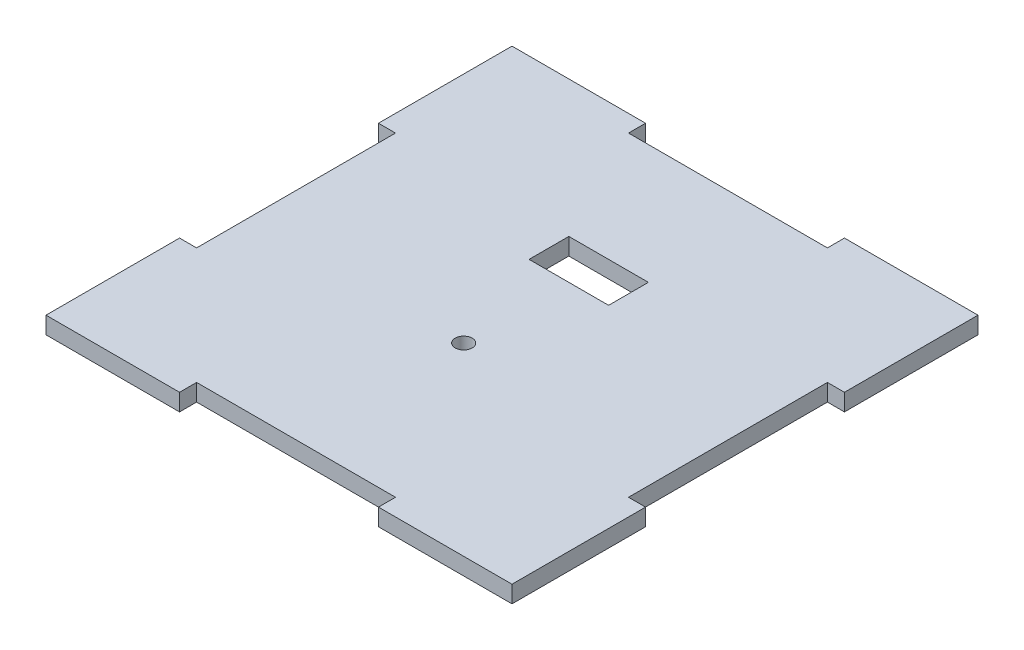
ISO-10303-21;
HEADER;
FILE_DESCRIPTION(('STEP AP214'),'2;1');
FILE_NAME('part.step','',(''),(''),'','','');
FILE_SCHEMA(('AUTOMOTIVE_DESIGN { 1 0 10303 214 1 1 1 1 }'));
ENDSEC;
DATA;
#1=APPLICATION_CONTEXT('core data for automotive mechanical design processes');
#2=APPLICATION_PROTOCOL_DEFINITION('international standard','automotive_design',2000,#1);
#3=PRODUCT_CONTEXT('',#1,'mechanical');
#4=PRODUCT('Part','Part','',(#3));
#5=PRODUCT_RELATED_PRODUCT_CATEGORY('part','',(#4));
#6=PRODUCT_DEFINITION_FORMATION('','',#4);
#7=PRODUCT_DEFINITION_CONTEXT('part definition',#1,'design');
#8=PRODUCT_DEFINITION('design','',#6,#7);
#9=PRODUCT_DEFINITION_SHAPE('','',#8);
#10=(LENGTH_UNIT() NAMED_UNIT(*) SI_UNIT(.MILLI.,.METRE.));
#11=(NAMED_UNIT(*) PLANE_ANGLE_UNIT() SI_UNIT($,.RADIAN.));
#12=(NAMED_UNIT(*) SI_UNIT($,.STERADIAN.) SOLID_ANGLE_UNIT());
#13=UNCERTAINTY_MEASURE_WITH_UNIT(LENGTH_MEASURE(1.E-05),#10,'distance_accuracy_value','');
#14=(GEOMETRIC_REPRESENTATION_CONTEXT(3) GLOBAL_UNCERTAINTY_ASSIGNED_CONTEXT((#13)) GLOBAL_UNIT_ASSIGNED_CONTEXT((#10,
#11,#12)) REPRESENTATION_CONTEXT('',''));
#15=CARTESIAN_POINT('',(0.,0.,0.));
#16=DIRECTION('',(0.,0.,1.));
#17=DIRECTION('',(1.,0.,0.));
#18=AXIS2_PLACEMENT_3D('',#15,#16,#17);
#19=CARTESIAN_POINT('',(41.,3.,-17.5));
#20=DIRECTION('',(-1.,0.,0.));
#21=DIRECTION('',(0.,0.,1.));
#22=AXIS2_PLACEMENT_3D('',#19,#20,#21);
#23=PLANE('',#22);
#24=DIRECTION('',(0.,0.,-1.));
#25=VECTOR('',#24,1.);
#26=CARTESIAN_POINT('',(41.,0.,-17.5));
#27=LINE('',#26,#25);
#28=CARTESIAN_POINT('',(41.,0.,-17.5));
#29=VERTEX_POINT('',#28);
#30=CARTESIAN_POINT('',(41.,0.,-41.));
#31=VERTEX_POINT('',#30);
#32=EDGE_CURVE('E243',#29,#31,#27,.T.);
#33=ORIENTED_EDGE('',*,*,#32,.T.);
#34=DIRECTION('',(0.,-1.,0.));
#35=VECTOR('',#34,1.);
#36=CARTESIAN_POINT('',(41.,3.,-41.));
#37=LINE('',#36,#35);
#38=CARTESIAN_POINT('',(41.,3.,-41.));
#39=VERTEX_POINT('',#38);
#40=EDGE_CURVE('E11',#39,#31,#37,.T.);
#41=ORIENTED_EDGE('',*,*,#40,.F.);
#42=DIRECTION('',(0.,0.,-1.));
#43=VECTOR('',#42,1.);
#44=CARTESIAN_POINT('',(41.,3.,-17.5));
#45=LINE('',#44,#43);
#46=CARTESIAN_POINT('',(41.,3.,-17.5));
#47=VERTEX_POINT('',#46);
#48=EDGE_CURVE('E256',#47,#39,#45,.T.);
#49=ORIENTED_EDGE('',*,*,#48,.F.);
#50=DIRECTION('',(0.,-1.,0.));
#51=VECTOR('',#50,1.);
#52=CARTESIAN_POINT('',(41.,3.,-17.5));
#53=LINE('',#52,#51);
#54=EDGE_CURVE('E318',#47,#29,#53,.T.);
#55=ORIENTED_EDGE('',*,*,#54,.T.);
#56=EDGE_LOOP('',(#33,#41,#49,#55));
#57=FACE_BOUND('',#56,.T.);
#58=ADVANCED_FACE('F38',(#57),#23,.F.);
#59=CARTESIAN_POINT('',(17.5,3.,-41.));
#60=DIRECTION('',(0.,0.,1.));
#61=DIRECTION('',(1.,0.,0.));
#62=AXIS2_PLACEMENT_3D('',#59,#60,#61);
#63=PLANE('',#62);
#64=DIRECTION('',(-1.,0.,0.));
#65=VECTOR('',#64,1.);
#66=CARTESIAN_POINT('',(17.5,0.,-41.));
#67=LINE('',#66,#65);
#68=CARTESIAN_POINT('',(17.5,0.,-41.));
#69=VERTEX_POINT('',#68);
#70=EDGE_CURVE('E322',#31,#69,#67,.T.);
#71=ORIENTED_EDGE('',*,*,#70,.T.);
#72=DIRECTION('',(0.,-1.,0.));
#73=VECTOR('',#72,1.);
#74=CARTESIAN_POINT('',(17.5,3.,-41.));
#75=LINE('',#74,#73);
#76=CARTESIAN_POINT('',(17.5,3.,-41.));
#77=VERTEX_POINT('',#76);
#78=EDGE_CURVE('E46',#77,#69,#75,.T.);
#79=ORIENTED_EDGE('',*,*,#78,.F.);
#80=DIRECTION('',(-1.,0.,0.));
#81=VECTOR('',#80,1.);
#82=CARTESIAN_POINT('',(17.5,3.,-41.));
#83=LINE('',#82,#81);
#84=EDGE_CURVE('E260',#39,#77,#83,.T.);
#85=ORIENTED_EDGE('',*,*,#84,.F.);
#86=ORIENTED_EDGE('',*,*,#40,.T.);
#87=EDGE_LOOP('',(#71,#79,#85,#86));
#88=FACE_BOUND('',#87,.T.);
#89=ADVANCED_FACE('F476',(#88),#63,.F.);
#90=CARTESIAN_POINT('',(17.5,3.,-38.));
#91=DIRECTION('',(1.,0.,0.));
#92=DIRECTION('',(0.,0.,-1.));
#93=AXIS2_PLACEMENT_3D('',#90,#91,#92);
#94=PLANE('',#93);
#95=DIRECTION('',(0.,0.,1.));
#96=VECTOR('',#95,1.);
#97=CARTESIAN_POINT('',(17.5,0.,-38.));
#98=LINE('',#97,#96);
#99=CARTESIAN_POINT('',(17.5,0.,-38.));
#100=VERTEX_POINT('',#99);
#101=EDGE_CURVE('E325',#69,#100,#98,.T.);
#102=ORIENTED_EDGE('',*,*,#101,.T.);
#103=DIRECTION('',(0.,-1.,0.));
#104=VECTOR('',#103,1.);
#105=CARTESIAN_POINT('',(17.5,3.,-38.));
#106=LINE('',#105,#104);
#107=CARTESIAN_POINT('',(17.5,3.,-38.));
#108=VERTEX_POINT('',#107);
#109=EDGE_CURVE('E445',#108,#100,#106,.T.);
#110=ORIENTED_EDGE('',*,*,#109,.F.);
#111=DIRECTION('',(0.,0.,1.));
#112=VECTOR('',#111,1.);
#113=CARTESIAN_POINT('',(17.5,3.,-38.));
#114=LINE('',#113,#112);
#115=EDGE_CURVE('E264',#77,#108,#114,.T.);
#116=ORIENTED_EDGE('',*,*,#115,.F.);
#117=ORIENTED_EDGE('',*,*,#78,.T.);
#118=EDGE_LOOP('',(#102,#110,#116,#117));
#119=FACE_BOUND('',#118,.T.);
#120=ADVANCED_FACE('F454',(#119),#94,.F.);
#121=CARTESIAN_POINT('',(-17.5,3.,-38.));
#122=DIRECTION('',(0.,0.,1.));
#123=DIRECTION('',(1.,0.,0.));
#124=AXIS2_PLACEMENT_3D('',#121,#122,#123);
#125=PLANE('',#124);
#126=DIRECTION('',(-1.,0.,0.));
#127=VECTOR('',#126,1.);
#128=CARTESIAN_POINT('',(-17.5,0.,-38.));
#129=LINE('',#128,#127);
#130=CARTESIAN_POINT('',(-17.5,0.,-38.));
#131=VERTEX_POINT('',#130);
#132=EDGE_CURVE('E328',#100,#131,#129,.T.);
#133=ORIENTED_EDGE('',*,*,#132,.T.);
#134=DIRECTION('',(0.,-1.,0.));
#135=VECTOR('',#134,1.);
#136=CARTESIAN_POINT('',(-17.5,3.,-38.));
#137=LINE('',#136,#135);
#138=CARTESIAN_POINT('',(-17.5,3.,-38.));
#139=VERTEX_POINT('',#138);
#140=EDGE_CURVE('E441',#139,#131,#137,.T.);
#141=ORIENTED_EDGE('',*,*,#140,.F.);
#142=DIRECTION('',(-1.,0.,0.));
#143=VECTOR('',#142,1.);
#144=CARTESIAN_POINT('',(-17.5,3.,-38.));
#145=LINE('',#144,#143);
#146=EDGE_CURVE('E267',#108,#139,#145,.T.);
#147=ORIENTED_EDGE('',*,*,#146,.F.);
#148=ORIENTED_EDGE('',*,*,#109,.T.);
#149=EDGE_LOOP('',(#133,#141,#147,#148));
#150=FACE_BOUND('',#149,.T.);
#151=ADVANCED_FACE('F464',(#150),#125,.F.);
#152=CARTESIAN_POINT('',(-17.5,3.,-41.));
#153=DIRECTION('',(-1.,0.,0.));
#154=DIRECTION('',(0.,0.,1.));
#155=AXIS2_PLACEMENT_3D('',#152,#153,#154);
#156=PLANE('',#155);
#157=DIRECTION('',(0.,0.,-1.));
#158=VECTOR('',#157,1.);
#159=CARTESIAN_POINT('',(-17.5,0.,-41.));
#160=LINE('',#159,#158);
#161=CARTESIAN_POINT('',(-17.5,0.,-41.));
#162=VERTEX_POINT('',#161);
#163=EDGE_CURVE('E331',#131,#162,#160,.T.);
#164=ORIENTED_EDGE('',*,*,#163,.T.);
#165=DIRECTION('',(0.,-1.,0.));
#166=VECTOR('',#165,1.);
#167=CARTESIAN_POINT('',(-17.5,3.,-41.));
#168=LINE('',#167,#166);
#169=CARTESIAN_POINT('',(-17.5,3.,-41.));
#170=VERTEX_POINT('',#169);
#171=EDGE_CURVE('E437',#170,#162,#168,.T.);
#172=ORIENTED_EDGE('',*,*,#171,.F.);
#173=DIRECTION('',(0.,0.,-1.));
#174=VECTOR('',#173,1.);
#175=CARTESIAN_POINT('',(-17.5,3.,-41.));
#176=LINE('',#175,#174);
#177=EDGE_CURVE('E270',#139,#170,#176,.T.);
#178=ORIENTED_EDGE('',*,*,#177,.F.);
#179=ORIENTED_EDGE('',*,*,#140,.T.);
#180=EDGE_LOOP('',(#164,#172,#178,#179));
#181=FACE_BOUND('',#180,.T.);
#182=ADVANCED_FACE('F468',(#181),#156,.F.);
#183=CARTESIAN_POINT('',(-41.,3.,-41.));
#184=DIRECTION('',(0.,0.,1.));
#185=DIRECTION('',(1.,0.,0.));
#186=AXIS2_PLACEMENT_3D('',#183,#184,#185);
#187=PLANE('',#186);
#188=DIRECTION('',(-1.,0.,0.));
#189=VECTOR('',#188,1.);
#190=CARTESIAN_POINT('',(-41.,0.,-41.));
#191=LINE('',#190,#189);
#192=CARTESIAN_POINT('',(-41.,0.,-41.));
#193=VERTEX_POINT('',#192);
#194=EDGE_CURVE('E334',#162,#193,#191,.T.);
#195=ORIENTED_EDGE('',*,*,#194,.T.);
#196=DIRECTION('',(0.,-1.,0.));
#197=VECTOR('',#196,1.);
#198=CARTESIAN_POINT('',(-41.,3.,-41.));
#199=LINE('',#198,#197);
#200=CARTESIAN_POINT('',(-41.,3.,-41.));
#201=VERTEX_POINT('',#200);
#202=EDGE_CURVE('E433',#201,#193,#199,.T.);
#203=ORIENTED_EDGE('',*,*,#202,.F.);
#204=DIRECTION('',(-1.,0.,0.));
#205=VECTOR('',#204,1.);
#206=CARTESIAN_POINT('',(-41.,3.,-41.));
#207=LINE('',#206,#205);
#208=EDGE_CURVE('E273',#170,#201,#207,.T.);
#209=ORIENTED_EDGE('',*,*,#208,.F.);
#210=ORIENTED_EDGE('',*,*,#171,.T.);
#211=EDGE_LOOP('',(#195,#203,#209,#210));
#212=FACE_BOUND('',#211,.T.);
#213=ADVANCED_FACE('F549',(#212),#187,.F.);
#214=CARTESIAN_POINT('',(-41.,3.,-17.5));
#215=DIRECTION('',(1.,0.,0.));
#216=DIRECTION('',(0.,0.,-1.));
#217=AXIS2_PLACEMENT_3D('',#214,#215,#216);
#218=PLANE('',#217);
#219=DIRECTION('',(0.,0.,1.));
#220=VECTOR('',#219,1.);
#221=CARTESIAN_POINT('',(-41.,0.,-17.5));
#222=LINE('',#221,#220);
#223=CARTESIAN_POINT('',(-41.,0.,-17.5));
#224=VERTEX_POINT('',#223);
#225=EDGE_CURVE('E337',#193,#224,#222,.T.);
#226=ORIENTED_EDGE('',*,*,#225,.T.);
#227=DIRECTION('',(0.,-1.,0.));
#228=VECTOR('',#227,1.);
#229=CARTESIAN_POINT('',(-41.,3.,-17.5));
#230=LINE('',#229,#228);
#231=CARTESIAN_POINT('',(-41.,3.,-17.5));
#232=VERTEX_POINT('',#231);
#233=EDGE_CURVE('E429',#232,#224,#230,.T.);
#234=ORIENTED_EDGE('',*,*,#233,.F.);
#235=DIRECTION('',(0.,0.,1.));
#236=VECTOR('',#235,1.);
#237=CARTESIAN_POINT('',(-41.,3.,-17.5));
#238=LINE('',#237,#236);
#239=EDGE_CURVE('E276',#201,#232,#238,.T.);
#240=ORIENTED_EDGE('',*,*,#239,.F.);
#241=ORIENTED_EDGE('',*,*,#202,.T.);
#242=EDGE_LOOP('',(#226,#234,#240,#241));
#243=FACE_BOUND('',#242,.T.);
#244=ADVANCED_FACE('F547',(#243),#218,.F.);
#245=CARTESIAN_POINT('',(-41.,3.,-17.5));
#246=DIRECTION('',(0.,0.,-1.));
#247=DIRECTION('',(-1.,0.,0.));
#248=AXIS2_PLACEMENT_3D('',#245,#246,#247);
#249=PLANE('',#248);
#250=DIRECTION('',(1.,0.,0.));
#251=VECTOR('',#250,1.);
#252=CARTESIAN_POINT('',(-41.,0.,-17.5));
#253=LINE('',#252,#251);
#254=CARTESIAN_POINT('',(-38.,0.,-17.5));
#255=VERTEX_POINT('',#254);
#256=EDGE_CURVE('E340',#224,#255,#253,.T.);
#257=ORIENTED_EDGE('',*,*,#256,.T.);
#258=DIRECTION('',(0.,-1.,0.));
#259=VECTOR('',#258,1.);
#260=CARTESIAN_POINT('',(-38.,3.,-17.5));
#261=LINE('',#260,#259);
#262=CARTESIAN_POINT('',(-38.,3.,-17.5));
#263=VERTEX_POINT('',#262);
#264=EDGE_CURVE('E425',#263,#255,#261,.T.);
#265=ORIENTED_EDGE('',*,*,#264,.F.);
#266=DIRECTION('',(1.,0.,0.));
#267=VECTOR('',#266,1.);
#268=CARTESIAN_POINT('',(-41.,3.,-17.5));
#269=LINE('',#268,#267);
#270=EDGE_CURVE('E279',#232,#263,#269,.T.);
#271=ORIENTED_EDGE('',*,*,#270,.F.);
#272=ORIENTED_EDGE('',*,*,#233,.T.);
#273=EDGE_LOOP('',(#257,#265,#271,#272));
#274=FACE_BOUND('',#273,.T.);
#275=ADVANCED_FACE('F542',(#274),#249,.F.);
#276=CARTESIAN_POINT('',(-38.,3.,-17.5));
#277=DIRECTION('',(1.,0.,0.));
#278=DIRECTION('',(0.,0.,-1.));
#279=AXIS2_PLACEMENT_3D('',#276,#277,#278);
#280=PLANE('',#279);
#281=DIRECTION('',(0.,0.,1.));
#282=VECTOR('',#281,1.);
#283=CARTESIAN_POINT('',(-38.,0.,-17.5));
#284=LINE('',#283,#282);
#285=CARTESIAN_POINT('',(-38.,0.,17.5));
#286=VERTEX_POINT('',#285);
#287=EDGE_CURVE('E343',#255,#286,#284,.T.);
#288=ORIENTED_EDGE('',*,*,#287,.T.);
#289=DIRECTION('',(0.,-1.,0.));
#290=VECTOR('',#289,1.);
#291=CARTESIAN_POINT('',(-38.,3.,17.5));
#292=LINE('',#291,#290);
#293=CARTESIAN_POINT('',(-38.,3.,17.5));
#294=VERTEX_POINT('',#293);
#295=EDGE_CURVE('E421',#294,#286,#292,.T.);
#296=ORIENTED_EDGE('',*,*,#295,.F.);
#297=DIRECTION('',(0.,0.,1.));
#298=VECTOR('',#297,1.);
#299=CARTESIAN_POINT('',(-38.,3.,-17.5));
#300=LINE('',#299,#298);
#301=EDGE_CURVE('E282',#263,#294,#300,.T.);
#302=ORIENTED_EDGE('',*,*,#301,.F.);
#303=ORIENTED_EDGE('',*,*,#264,.T.);
#304=EDGE_LOOP('',(#288,#296,#302,#303));
#305=FACE_BOUND('',#304,.T.);
#306=ADVANCED_FACE('F537',(#305),#280,.F.);
#307=CARTESIAN_POINT('',(-38.,3.,17.5));
#308=DIRECTION('',(0.,0.,1.));
#309=DIRECTION('',(1.,0.,0.));
#310=AXIS2_PLACEMENT_3D('',#307,#308,#309);
#311=PLANE('',#310);
#312=DIRECTION('',(-1.,0.,0.));
#313=VECTOR('',#312,1.);
#314=CARTESIAN_POINT('',(-38.,0.,17.5));
#315=LINE('',#314,#313);
#316=CARTESIAN_POINT('',(-41.,0.,17.5));
#317=VERTEX_POINT('',#316);
#318=EDGE_CURVE('E346',#286,#317,#315,.T.);
#319=ORIENTED_EDGE('',*,*,#318,.T.);
#320=DIRECTION('',(0.,-1.,0.));
#321=VECTOR('',#320,1.);
#322=CARTESIAN_POINT('',(-41.,3.,17.5));
#323=LINE('',#322,#321);
#324=CARTESIAN_POINT('',(-41.,3.,17.5));
#325=VERTEX_POINT('',#324);
#326=EDGE_CURVE('E417',#325,#317,#323,.T.);
#327=ORIENTED_EDGE('',*,*,#326,.F.);
#328=DIRECTION('',(-1.,0.,0.));
#329=VECTOR('',#328,1.);
#330=CARTESIAN_POINT('',(-38.,3.,17.5));
#331=LINE('',#330,#329);
#332=EDGE_CURVE('E285',#294,#325,#331,.T.);
#333=ORIENTED_EDGE('',*,*,#332,.F.);
#334=ORIENTED_EDGE('',*,*,#295,.T.);
#335=EDGE_LOOP('',(#319,#327,#333,#334));
#336=FACE_BOUND('',#335,.T.);
#337=ADVANCED_FACE('F533',(#336),#311,.F.);
#338=CARTESIAN_POINT('',(-41.,3.,41.));
#339=DIRECTION('',(1.,0.,0.));
#340=DIRECTION('',(0.,0.,-1.));
#341=AXIS2_PLACEMENT_3D('',#338,#339,#340);
#342=PLANE('',#341);
#343=DIRECTION('',(0.,0.,1.));
#344=VECTOR('',#343,1.);
#345=CARTESIAN_POINT('',(-41.,0.,41.));
#346=LINE('',#345,#344);
#347=CARTESIAN_POINT('',(-41.,0.,41.));
#348=VERTEX_POINT('',#347);
#349=EDGE_CURVE('E349',#317,#348,#346,.T.);
#350=ORIENTED_EDGE('',*,*,#349,.T.);
#351=DIRECTION('',(0.,-1.,0.));
#352=VECTOR('',#351,1.);
#353=CARTESIAN_POINT('',(-41.,3.,41.));
#354=LINE('',#353,#352);
#355=CARTESIAN_POINT('',(-41.,3.,41.));
#356=VERTEX_POINT('',#355);
#357=EDGE_CURVE('E413',#356,#348,#354,.T.);
#358=ORIENTED_EDGE('',*,*,#357,.F.);
#359=DIRECTION('',(0.,0.,1.));
#360=VECTOR('',#359,1.);
#361=CARTESIAN_POINT('',(-41.,3.,41.));
#362=LINE('',#361,#360);
#363=EDGE_CURVE('E288',#325,#356,#362,.T.);
#364=ORIENTED_EDGE('',*,*,#363,.F.);
#365=ORIENTED_EDGE('',*,*,#326,.T.);
#366=EDGE_LOOP('',(#350,#358,#364,#365));
#367=FACE_BOUND('',#366,.T.);
#368=ADVANCED_FACE('F528',(#367),#342,.F.);
#369=CARTESIAN_POINT('',(-41.,3.,41.));
#370=DIRECTION('',(0.,0.,-1.));
#371=DIRECTION('',(-1.,0.,0.));
#372=AXIS2_PLACEMENT_3D('',#369,#370,#371);
#373=PLANE('',#372);
#374=DIRECTION('',(1.,0.,0.));
#375=VECTOR('',#374,1.);
#376=CARTESIAN_POINT('',(-41.,0.,41.));
#377=LINE('',#376,#375);
#378=CARTESIAN_POINT('',(-17.5,0.,41.));
#379=VERTEX_POINT('',#378);
#380=EDGE_CURVE('E352',#348,#379,#377,.T.);
#381=ORIENTED_EDGE('',*,*,#380,.T.);
#382=DIRECTION('',(0.,-1.,0.));
#383=VECTOR('',#382,1.);
#384=CARTESIAN_POINT('',(-17.5,3.,41.));
#385=LINE('',#384,#383);
#386=CARTESIAN_POINT('',(-17.5,3.,41.));
#387=VERTEX_POINT('',#386);
#388=EDGE_CURVE('E409',#387,#379,#385,.T.);
#389=ORIENTED_EDGE('',*,*,#388,.F.);
#390=DIRECTION('',(1.,0.,0.));
#391=VECTOR('',#390,1.);
#392=CARTESIAN_POINT('',(-41.,3.,41.));
#393=LINE('',#392,#391);
#394=EDGE_CURVE('E291',#356,#387,#393,.T.);
#395=ORIENTED_EDGE('',*,*,#394,.F.);
#396=ORIENTED_EDGE('',*,*,#357,.T.);
#397=EDGE_LOOP('',(#381,#389,#395,#396));
#398=FACE_BOUND('',#397,.T.);
#399=ADVANCED_FACE('F522',(#398),#373,.F.);
#400=CARTESIAN_POINT('',(-17.5,3.,38.));
#401=DIRECTION('',(-1.,0.,0.));
#402=DIRECTION('',(0.,0.,1.));
#403=AXIS2_PLACEMENT_3D('',#400,#401,#402);
#404=PLANE('',#403);
#405=DIRECTION('',(0.,0.,-1.));
#406=VECTOR('',#405,1.);
#407=CARTESIAN_POINT('',(-17.5,0.,38.));
#408=LINE('',#407,#406);
#409=CARTESIAN_POINT('',(-17.5,0.,38.));
#410=VERTEX_POINT('',#409);
#411=EDGE_CURVE('E355',#379,#410,#408,.T.);
#412=ORIENTED_EDGE('',*,*,#411,.T.);
#413=DIRECTION('',(0.,-1.,0.));
#414=VECTOR('',#413,1.);
#415=CARTESIAN_POINT('',(-17.5,3.,38.));
#416=LINE('',#415,#414);
#417=CARTESIAN_POINT('',(-17.5,3.,38.));
#418=VERTEX_POINT('',#417);
#419=EDGE_CURVE('E405',#418,#410,#416,.T.);
#420=ORIENTED_EDGE('',*,*,#419,.F.);
#421=DIRECTION('',(0.,0.,-1.));
#422=VECTOR('',#421,1.);
#423=CARTESIAN_POINT('',(-17.5,3.,38.));
#424=LINE('',#423,#422);
#425=EDGE_CURVE('E294',#387,#418,#424,.T.);
#426=ORIENTED_EDGE('',*,*,#425,.F.);
#427=ORIENTED_EDGE('',*,*,#388,.T.);
#428=EDGE_LOOP('',(#412,#420,#426,#427));
#429=FACE_BOUND('',#428,.T.);
#430=ADVANCED_FACE('F518',(#429),#404,.F.);
#431=CARTESIAN_POINT('',(17.5,3.,38.));
#432=DIRECTION('',(0.,0.,-1.));
#433=DIRECTION('',(-1.,0.,0.));
#434=AXIS2_PLACEMENT_3D('',#431,#432,#433);
#435=PLANE('',#434);
#436=DIRECTION('',(1.,0.,0.));
#437=VECTOR('',#436,1.);
#438=CARTESIAN_POINT('',(17.5,0.,38.));
#439=LINE('',#438,#437);
#440=CARTESIAN_POINT('',(17.5,0.,38.));
#441=VERTEX_POINT('',#440);
#442=EDGE_CURVE('E358',#410,#441,#439,.T.);
#443=ORIENTED_EDGE('',*,*,#442,.T.);
#444=DIRECTION('',(0.,-1.,0.));
#445=VECTOR('',#444,1.);
#446=CARTESIAN_POINT('',(17.5,3.,38.));
#447=LINE('',#446,#445);
#448=CARTESIAN_POINT('',(17.5,3.,38.));
#449=VERTEX_POINT('',#448);
#450=EDGE_CURVE('E401',#449,#441,#447,.T.);
#451=ORIENTED_EDGE('',*,*,#450,.F.);
#452=DIRECTION('',(1.,0.,0.));
#453=VECTOR('',#452,1.);
#454=CARTESIAN_POINT('',(17.5,3.,38.));
#455=LINE('',#454,#453);
#456=EDGE_CURVE('E297',#418,#449,#455,.T.);
#457=ORIENTED_EDGE('',*,*,#456,.F.);
#458=ORIENTED_EDGE('',*,*,#419,.T.);
#459=EDGE_LOOP('',(#443,#451,#457,#458));
#460=FACE_BOUND('',#459,.T.);
#461=ADVANCED_FACE('F513',(#460),#435,.F.);
#462=CARTESIAN_POINT('',(17.5,3.,41.));
#463=DIRECTION('',(1.,0.,0.));
#464=DIRECTION('',(0.,0.,-1.));
#465=AXIS2_PLACEMENT_3D('',#462,#463,#464);
#466=PLANE('',#465);
#467=DIRECTION('',(0.,0.,1.));
#468=VECTOR('',#467,1.);
#469=CARTESIAN_POINT('',(17.5,0.,41.));
#470=LINE('',#469,#468);
#471=CARTESIAN_POINT('',(17.5,0.,41.));
#472=VERTEX_POINT('',#471);
#473=EDGE_CURVE('E361',#441,#472,#470,.T.);
#474=ORIENTED_EDGE('',*,*,#473,.T.);
#475=DIRECTION('',(0.,-1.,0.));
#476=VECTOR('',#475,1.);
#477=CARTESIAN_POINT('',(17.5,3.,41.));
#478=LINE('',#477,#476);
#479=CARTESIAN_POINT('',(17.5,3.,41.));
#480=VERTEX_POINT('',#479);
#481=EDGE_CURVE('E397',#480,#472,#478,.T.);
#482=ORIENTED_EDGE('',*,*,#481,.F.);
#483=DIRECTION('',(0.,0.,1.));
#484=VECTOR('',#483,1.);
#485=CARTESIAN_POINT('',(17.5,3.,41.));
#486=LINE('',#485,#484);
#487=EDGE_CURVE('E300',#449,#480,#486,.T.);
#488=ORIENTED_EDGE('',*,*,#487,.F.);
#489=ORIENTED_EDGE('',*,*,#450,.T.);
#490=EDGE_LOOP('',(#474,#482,#488,#489));
#491=FACE_BOUND('',#490,.T.);
#492=ADVANCED_FACE('F507',(#491),#466,.F.);
#493=CARTESIAN_POINT('',(17.5,3.,41.));
#494=DIRECTION('',(0.,0.,-1.));
#495=DIRECTION('',(-1.,0.,0.));
#496=AXIS2_PLACEMENT_3D('',#493,#494,#495);
#497=PLANE('',#496);
#498=DIRECTION('',(1.,0.,0.));
#499=VECTOR('',#498,1.);
#500=CARTESIAN_POINT('',(17.5,0.,41.));
#501=LINE('',#500,#499);
#502=CARTESIAN_POINT('',(41.,0.,41.));
#503=VERTEX_POINT('',#502);
#504=EDGE_CURVE('E364',#472,#503,#501,.T.);
#505=ORIENTED_EDGE('',*,*,#504,.T.);
#506=DIRECTION('',(0.,-1.,0.));
#507=VECTOR('',#506,1.);
#508=CARTESIAN_POINT('',(41.,3.,41.));
#509=LINE('',#508,#507);
#510=CARTESIAN_POINT('',(41.,3.,41.));
#511=VERTEX_POINT('',#510);
#512=EDGE_CURVE('E393',#511,#503,#509,.T.);
#513=ORIENTED_EDGE('',*,*,#512,.F.);
#514=DIRECTION('',(1.,0.,0.));
#515=VECTOR('',#514,1.);
#516=CARTESIAN_POINT('',(17.5,3.,41.));
#517=LINE('',#516,#515);
#518=EDGE_CURVE('E303',#480,#511,#517,.T.);
#519=ORIENTED_EDGE('',*,*,#518,.F.);
#520=ORIENTED_EDGE('',*,*,#481,.T.);
#521=EDGE_LOOP('',(#505,#513,#519,#520));
#522=FACE_BOUND('',#521,.T.);
#523=ADVANCED_FACE('F503',(#522),#497,.F.);
#524=CARTESIAN_POINT('',(41.,3.,41.));
#525=DIRECTION('',(-1.,0.,0.));
#526=DIRECTION('',(0.,0.,1.));
#527=AXIS2_PLACEMENT_3D('',#524,#525,#526);
#528=PLANE('',#527);
#529=DIRECTION('',(0.,0.,-1.));
#530=VECTOR('',#529,1.);
#531=CARTESIAN_POINT('',(41.,0.,41.));
#532=LINE('',#531,#530);
#533=CARTESIAN_POINT('',(41.,0.,17.5));
#534=VERTEX_POINT('',#533);
#535=EDGE_CURVE('E367',#503,#534,#532,.T.);
#536=ORIENTED_EDGE('',*,*,#535,.T.);
#537=DIRECTION('',(0.,-1.,0.));
#538=VECTOR('',#537,1.);
#539=CARTESIAN_POINT('',(41.,3.,17.5));
#540=LINE('',#539,#538);
#541=CARTESIAN_POINT('',(41.,3.,17.5));
#542=VERTEX_POINT('',#541);
#543=EDGE_CURVE('E389',#542,#534,#540,.T.);
#544=ORIENTED_EDGE('',*,*,#543,.F.);
#545=DIRECTION('',(0.,0.,-1.));
#546=VECTOR('',#545,1.);
#547=CARTESIAN_POINT('',(41.,3.,41.));
#548=LINE('',#547,#546);
#549=EDGE_CURVE('E306',#511,#542,#548,.T.);
#550=ORIENTED_EDGE('',*,*,#549,.F.);
#551=ORIENTED_EDGE('',*,*,#512,.T.);
#552=EDGE_LOOP('',(#536,#544,#550,#551));
#553=FACE_BOUND('',#552,.T.);
#554=ADVANCED_FACE('F498',(#553),#528,.F.);
#555=CARTESIAN_POINT('',(38.,3.,17.5));
#556=DIRECTION('',(0.,0.,1.));
#557=DIRECTION('',(1.,0.,0.));
#558=AXIS2_PLACEMENT_3D('',#555,#556,#557);
#559=PLANE('',#558);
#560=DIRECTION('',(-1.,0.,0.));
#561=VECTOR('',#560,1.);
#562=CARTESIAN_POINT('',(38.,0.,17.5));
#563=LINE('',#562,#561);
#564=CARTESIAN_POINT('',(38.,0.,17.5));
#565=VERTEX_POINT('',#564);
#566=EDGE_CURVE('E370',#534,#565,#563,.T.);
#567=ORIENTED_EDGE('',*,*,#566,.T.);
#568=DIRECTION('',(0.,-1.,0.));
#569=VECTOR('',#568,1.);
#570=CARTESIAN_POINT('',(38.,3.,17.5));
#571=LINE('',#570,#569);
#572=CARTESIAN_POINT('',(38.,3.,17.5));
#573=VERTEX_POINT('',#572);
#574=EDGE_CURVE('E385',#573,#565,#571,.T.);
#575=ORIENTED_EDGE('',*,*,#574,.F.);
#576=DIRECTION('',(-1.,0.,0.));
#577=VECTOR('',#576,1.);
#578=CARTESIAN_POINT('',(38.,3.,17.5));
#579=LINE('',#578,#577);
#580=EDGE_CURVE('E309',#542,#573,#579,.T.);
#581=ORIENTED_EDGE('',*,*,#580,.F.);
#582=ORIENTED_EDGE('',*,*,#543,.T.);
#583=EDGE_LOOP('',(#567,#575,#581,#582));
#584=FACE_BOUND('',#583,.T.);
#585=ADVANCED_FACE('F492',(#584),#559,.F.);
#586=CARTESIAN_POINT('',(38.,3.,-17.5));
#587=DIRECTION('',(-1.,0.,0.));
#588=DIRECTION('',(0.,0.,1.));
#589=AXIS2_PLACEMENT_3D('',#586,#587,#588);
#590=PLANE('',#589);
#591=DIRECTION('',(0.,0.,-1.));
#592=VECTOR('',#591,1.);
#593=CARTESIAN_POINT('',(38.,0.,-17.5));
#594=LINE('',#593,#592);
#595=CARTESIAN_POINT('',(38.,0.,-17.5));
#596=VERTEX_POINT('',#595);
#597=EDGE_CURVE('E373',#565,#596,#594,.T.);
#598=ORIENTED_EDGE('',*,*,#597,.T.);
#599=DIRECTION('',(0.,-1.,0.));
#600=VECTOR('',#599,1.);
#601=CARTESIAN_POINT('',(38.,3.,-17.5));
#602=LINE('',#601,#600);
#603=CARTESIAN_POINT('',(38.,3.,-17.5));
#604=VERTEX_POINT('',#603);
#605=EDGE_CURVE('E381',#604,#596,#602,.T.);
#606=ORIENTED_EDGE('',*,*,#605,.F.);
#607=DIRECTION('',(0.,0.,-1.));
#608=VECTOR('',#607,1.);
#609=CARTESIAN_POINT('',(38.,3.,-17.5));
#610=LINE('',#609,#608);
#611=EDGE_CURVE('E312',#573,#604,#610,.T.);
#612=ORIENTED_EDGE('',*,*,#611,.F.);
#613=ORIENTED_EDGE('',*,*,#574,.T.);
#614=EDGE_LOOP('',(#598,#606,#612,#613));
#615=FACE_BOUND('',#614,.T.);
#616=ADVANCED_FACE('F488',(#615),#590,.F.);
#617=CARTESIAN_POINT('',(41.,3.,-17.5));
#618=DIRECTION('',(0.,0.,-1.));
#619=DIRECTION('',(-1.,0.,0.));
#620=AXIS2_PLACEMENT_3D('',#617,#618,#619);
#621=PLANE('',#620);
#622=DIRECTION('',(1.,0.,0.));
#623=VECTOR('',#622,1.);
#624=CARTESIAN_POINT('',(41.,0.,-17.5));
#625=LINE('',#624,#623);
#626=EDGE_CURVE('E261',#596,#29,#625,.T.);
#627=ORIENTED_EDGE('',*,*,#626,.T.);
#628=ORIENTED_EDGE('',*,*,#54,.F.);
#629=DIRECTION('',(1.,0.,0.));
#630=VECTOR('',#629,1.);
#631=CARTESIAN_POINT('',(41.,3.,-17.5));
#632=LINE('',#631,#630);
#633=EDGE_CURVE('E315',#604,#47,#632,.T.);
#634=ORIENTED_EDGE('',*,*,#633,.F.);
#635=ORIENTED_EDGE('',*,*,#605,.T.);
#636=EDGE_LOOP('',(#627,#628,#634,#635));
#637=FACE_BOUND('',#636,.T.);
#638=ADVANCED_FACE('F483',(#637),#621,.F.);
#639=CARTESIAN_POINT('',(0.,3.,0.));
#640=DIRECTION('',(0.,-1.,0.));
#641=DIRECTION('',(0.,0.,-1.));
#642=AXIS2_PLACEMENT_3D('',#639,#640,#641);
#643=PLANE('',#642);
#644=DIRECTION('',(-1.,0.,0.));
#645=VECTOR('',#644,1.);
#646=CARTESIAN_POINT('',(-7.,3.,-17.));
#647=LINE('',#646,#645);
#648=CARTESIAN_POINT('',(7.,3.,-17.));
#649=VERTEX_POINT('',#648);
#650=CARTESIAN_POINT('',(-7.,3.,-17.));
#651=VERTEX_POINT('',#650);
#652=EDGE_CURVE('E233',#649,#651,#647,.T.);
#653=ORIENTED_EDGE('',*,*,#652,.F.);
#654=DIRECTION('',(0.,0.,-1.));
#655=VECTOR('',#654,1.);
#656=CARTESIAN_POINT('',(7.,3.,-17.));
#657=LINE('',#656,#655);
#658=CARTESIAN_POINT('',(7.00000000000001,3.,-10.));
#659=VERTEX_POINT('',#658);
#660=EDGE_CURVE('E53',#659,#649,#657,.T.);
#661=ORIENTED_EDGE('',*,*,#660,.F.);
#662=DIRECTION('',(1.,0.,0.));
#663=VECTOR('',#662,1.);
#664=CARTESIAN_POINT('',(-7.,3.,-10.));
#665=LINE('',#664,#663);
#666=CARTESIAN_POINT('',(-7.,3.,-10.));
#667=VERTEX_POINT('',#666);
#668=EDGE_CURVE('E220',#667,#659,#665,.T.);
#669=ORIENTED_EDGE('',*,*,#668,.F.);
#670=DIRECTION('',(0.,0.,1.));
#671=VECTOR('',#670,1.);
#672=CARTESIAN_POINT('',(-7.,3.,-17.));
#673=LINE('',#672,#671);
#674=EDGE_CURVE('E224',#651,#667,#673,.T.);
#675=ORIENTED_EDGE('',*,*,#674,.F.);
#676=EDGE_LOOP('',(#653,#661,#669,#675));
#677=FACE_BOUND('',#676,.T.);
#678=CARTESIAN_POINT('',(0.,3.,8.5));
#679=DIRECTION('',(0.,1.,0.));
#680=DIRECTION('',(0.,0.,1.));
#681=AXIS2_PLACEMENT_3D('',#678,#679,#680);
#682=CIRCLE('',#681,1.5);
#683=CARTESIAN_POINT('',(0.,3.,10.));
#684=VERTEX_POINT('',#683);
#685=EDGE_CURVE('E252',#684,#684,#682,.T.);
#686=ORIENTED_EDGE('',*,*,#685,.F.);
#687=EDGE_LOOP('',(#686));
#688=FACE_BOUND('',#687,.T.);
#689=ORIENTED_EDGE('',*,*,#48,.T.);
#690=ORIENTED_EDGE('',*,*,#84,.T.);
#691=ORIENTED_EDGE('',*,*,#115,.T.);
#692=ORIENTED_EDGE('',*,*,#146,.T.);
#693=ORIENTED_EDGE('',*,*,#177,.T.);
#694=ORIENTED_EDGE('',*,*,#208,.T.);
#695=ORIENTED_EDGE('',*,*,#239,.T.);
#696=ORIENTED_EDGE('',*,*,#270,.T.);
#697=ORIENTED_EDGE('',*,*,#301,.T.);
#698=ORIENTED_EDGE('',*,*,#332,.T.);
#699=ORIENTED_EDGE('',*,*,#363,.T.);
#700=ORIENTED_EDGE('',*,*,#394,.T.);
#701=ORIENTED_EDGE('',*,*,#425,.T.);
#702=ORIENTED_EDGE('',*,*,#456,.T.);
#703=ORIENTED_EDGE('',*,*,#487,.T.);
#704=ORIENTED_EDGE('',*,*,#518,.T.);
#705=ORIENTED_EDGE('',*,*,#549,.T.);
#706=ORIENTED_EDGE('',*,*,#580,.T.);
#707=ORIENTED_EDGE('',*,*,#611,.T.);
#708=ORIENTED_EDGE('',*,*,#633,.T.);
#709=EDGE_LOOP('',(#689,#690,#691,#692,#693,#694,#695,#696,#697,#698,#699,#700,#701,#702,#703,
#704,#705,#706,#707,#708));
#710=FACE_BOUND('',#709,.T.);
#711=ADVANCED_FACE('F472',(#677,#688,#710),#643,.F.);
#712=CARTESIAN_POINT('',(0.,0.,0.));
#713=DIRECTION('',(0.,-1.,0.));
#714=DIRECTION('',(0.,0.,-1.));
#715=AXIS2_PLACEMENT_3D('',#712,#713,#714);
#716=PLANE('',#715);
#717=DIRECTION('',(0.,0.,-1.));
#718=VECTOR('',#717,1.);
#719=CARTESIAN_POINT('',(7.,0.,-17.));
#720=LINE('',#719,#718);
#721=CARTESIAN_POINT('',(7.00000000000001,0.,-10.));
#722=VERTEX_POINT('',#721);
#723=CARTESIAN_POINT('',(7.,0.,-17.));
#724=VERTEX_POINT('',#723);
#725=EDGE_CURVE('E201',#722,#724,#720,.T.);
#726=ORIENTED_EDGE('',*,*,#725,.T.);
#727=DIRECTION('',(-1.,0.,0.));
#728=VECTOR('',#727,1.);
#729=CARTESIAN_POINT('',(-7.,0.,-17.));
#730=LINE('',#729,#728);
#731=CARTESIAN_POINT('',(-7.,0.,-17.));
#732=VERTEX_POINT('',#731);
#733=EDGE_CURVE('E211',#724,#732,#730,.T.);
#734=ORIENTED_EDGE('',*,*,#733,.T.);
#735=DIRECTION('',(0.,0.,1.));
#736=VECTOR('',#735,1.);
#737=CARTESIAN_POINT('',(-7.,0.,-17.));
#738=LINE('',#737,#736);
#739=CARTESIAN_POINT('',(-7.,0.,-10.));
#740=VERTEX_POINT('',#739);
#741=EDGE_CURVE('E61',#732,#740,#738,.T.);
#742=ORIENTED_EDGE('',*,*,#741,.T.);
#743=DIRECTION('',(1.,0.,0.));
#744=VECTOR('',#743,1.);
#745=CARTESIAN_POINT('',(-7.,0.,-10.));
#746=LINE('',#745,#744);
#747=EDGE_CURVE('E208',#740,#722,#746,.T.);
#748=ORIENTED_EDGE('',*,*,#747,.T.);
#749=EDGE_LOOP('',(#726,#734,#742,#748));
#750=FACE_BOUND('',#749,.T.);
#751=CARTESIAN_POINT('',(0.,0.,8.5));
#752=DIRECTION('',(0.,1.,0.));
#753=DIRECTION('',(0.,0.,1.));
#754=AXIS2_PLACEMENT_3D('',#751,#752,#753);
#755=CIRCLE('',#754,1.5);
#756=CARTESIAN_POINT('',(0.,0.,10.));
#757=VERTEX_POINT('',#756);
#758=EDGE_CURVE('E234',#757,#757,#755,.T.);
#759=ORIENTED_EDGE('',*,*,#758,.T.);
#760=EDGE_LOOP('',(#759));
#761=FACE_BOUND('',#760,.T.);
#762=ORIENTED_EDGE('',*,*,#32,.F.);
#763=ORIENTED_EDGE('',*,*,#626,.F.);
#764=ORIENTED_EDGE('',*,*,#597,.F.);
#765=ORIENTED_EDGE('',*,*,#566,.F.);
#766=ORIENTED_EDGE('',*,*,#535,.F.);
#767=ORIENTED_EDGE('',*,*,#504,.F.);
#768=ORIENTED_EDGE('',*,*,#473,.F.);
#769=ORIENTED_EDGE('',*,*,#442,.F.);
#770=ORIENTED_EDGE('',*,*,#411,.F.);
#771=ORIENTED_EDGE('',*,*,#380,.F.);
#772=ORIENTED_EDGE('',*,*,#349,.F.);
#773=ORIENTED_EDGE('',*,*,#318,.F.);
#774=ORIENTED_EDGE('',*,*,#287,.F.);
#775=ORIENTED_EDGE('',*,*,#256,.F.);
#776=ORIENTED_EDGE('',*,*,#225,.F.);
#777=ORIENTED_EDGE('',*,*,#194,.F.);
#778=ORIENTED_EDGE('',*,*,#163,.F.);
#779=ORIENTED_EDGE('',*,*,#132,.F.);
#780=ORIENTED_EDGE('',*,*,#101,.F.);
#781=ORIENTED_EDGE('',*,*,#70,.F.);
#782=EDGE_LOOP('',(#762,#763,#764,#765,#766,#767,#768,#769,#770,#771,#772,#773,#774,#775,#776,
#777,#778,#779,#780,#781));
#783=FACE_BOUND('',#782,.T.);
#784=ADVANCED_FACE('F216',(#750,#761,#783),#716,.T.);
#785=CARTESIAN_POINT('',(0.,0.,8.5));
#786=DIRECTION('',(0.,1.,0.));
#787=DIRECTION('',(0.,0.,1.));
#788=AXIS2_PLACEMENT_3D('',#785,#786,#787);
#789=CYLINDRICAL_SURFACE('',#788,1.5);
#790=ORIENTED_EDGE('',*,*,#758,.F.);
#791=EDGE_LOOP('',(#790));
#792=FACE_BOUND('',#791,.T.);
#793=ORIENTED_EDGE('',*,*,#685,.T.);
#794=EDGE_LOOP('',(#793));
#795=FACE_BOUND('',#794,.T.);
#796=ADVANCED_FACE('F708',(#792,#795),#789,.F.);
#797=CARTESIAN_POINT('',(7.,0.,-17.));
#798=DIRECTION('',(1.,0.,0.));
#799=DIRECTION('',(0.,0.,-1.));
#800=AXIS2_PLACEMENT_3D('',#797,#798,#799);
#801=PLANE('',#800);
#802=ORIENTED_EDGE('',*,*,#660,.T.);
#803=DIRECTION('',(0.,1.,0.));
#804=VECTOR('',#803,1.);
#805=CARTESIAN_POINT('',(7.,0.,-17.));
#806=LINE('',#805,#804);
#807=EDGE_CURVE('E197',#724,#649,#806,.T.);
#808=ORIENTED_EDGE('',*,*,#807,.F.);
#809=ORIENTED_EDGE('',*,*,#725,.F.);
#810=DIRECTION('',(0.,1.,0.));
#811=VECTOR('',#810,1.);
#812=CARTESIAN_POINT('',(7.00000000000001,0.,-10.));
#813=LINE('',#812,#811);
#814=EDGE_CURVE('E240',#722,#659,#813,.T.);
#815=ORIENTED_EDGE('',*,*,#814,.T.);
#816=EDGE_LOOP('',(#802,#808,#809,#815));
#817=FACE_BOUND('',#816,.T.);
#818=ADVANCED_FACE('F199',(#817),#801,.F.);
#819=CARTESIAN_POINT('',(-7.,0.,-10.));
#820=DIRECTION('',(0.,0.,1.));
#821=DIRECTION('',(1.,0.,0.));
#822=AXIS2_PLACEMENT_3D('',#819,#820,#821);
#823=PLANE('',#822);
#824=ORIENTED_EDGE('',*,*,#668,.T.);
#825=ORIENTED_EDGE('',*,*,#814,.F.);
#826=ORIENTED_EDGE('',*,*,#747,.F.);
#827=DIRECTION('',(0.,1.,0.));
#828=VECTOR('',#827,1.);
#829=CARTESIAN_POINT('',(-7.,0.,-10.));
#830=LINE('',#829,#828);
#831=EDGE_CURVE('E244',#740,#667,#830,.T.);
#832=ORIENTED_EDGE('',*,*,#831,.T.);
#833=EDGE_LOOP('',(#824,#825,#826,#832));
#834=FACE_BOUND('',#833,.T.);
#835=ADVANCED_FACE('F726',(#834),#823,.F.);
#836=CARTESIAN_POINT('',(-7.,0.,-17.));
#837=DIRECTION('',(-1.,0.,0.));
#838=DIRECTION('',(0.,0.,1.));
#839=AXIS2_PLACEMENT_3D('',#836,#837,#838);
#840=PLANE('',#839);
#841=ORIENTED_EDGE('',*,*,#674,.T.);
#842=ORIENTED_EDGE('',*,*,#831,.F.);
#843=ORIENTED_EDGE('',*,*,#741,.F.);
#844=DIRECTION('',(0.,1.,0.));
#845=VECTOR('',#844,1.);
#846=CARTESIAN_POINT('',(-7.,0.,-17.));
#847=LINE('',#846,#845);
#848=EDGE_CURVE('E207',#732,#651,#847,.T.);
#849=ORIENTED_EDGE('',*,*,#848,.T.);
#850=EDGE_LOOP('',(#841,#842,#843,#849));
#851=FACE_BOUND('',#850,.T.);
#852=ADVANCED_FACE('F735',(#851),#840,.F.);
#853=CARTESIAN_POINT('',(-7.,0.,-17.));
#854=DIRECTION('',(0.,0.,-1.));
#855=DIRECTION('',(-1.,0.,0.));
#856=AXIS2_PLACEMENT_3D('',#853,#854,#855);
#857=PLANE('',#856);
#858=ORIENTED_EDGE('',*,*,#652,.T.);
#859=ORIENTED_EDGE('',*,*,#848,.F.);
#860=ORIENTED_EDGE('',*,*,#733,.F.);
#861=ORIENTED_EDGE('',*,*,#807,.T.);
#862=EDGE_LOOP('',(#858,#859,#860,#861));
#863=FACE_BOUND('',#862,.T.);
#864=ADVANCED_FACE('F212',(#863),#857,.F.);
#865=CLOSED_SHELL('',(#58,#89,#120,#151,#182,#213,#244,#275,#306,#337,#368,#399,#430,#461,#492,
#523,#554,#585,#616,#638,#711,#784,#796,#818,#835,#852,#864));
#866=MANIFOLD_SOLID_BREP('B2',#865);
#867=ADVANCED_BREP_SHAPE_REPRESENTATION('',(#18,#866),#14);
#868=SHAPE_DEFINITION_REPRESENTATION(#9,#867);
ENDSEC;
END-ISO-10303-21;
